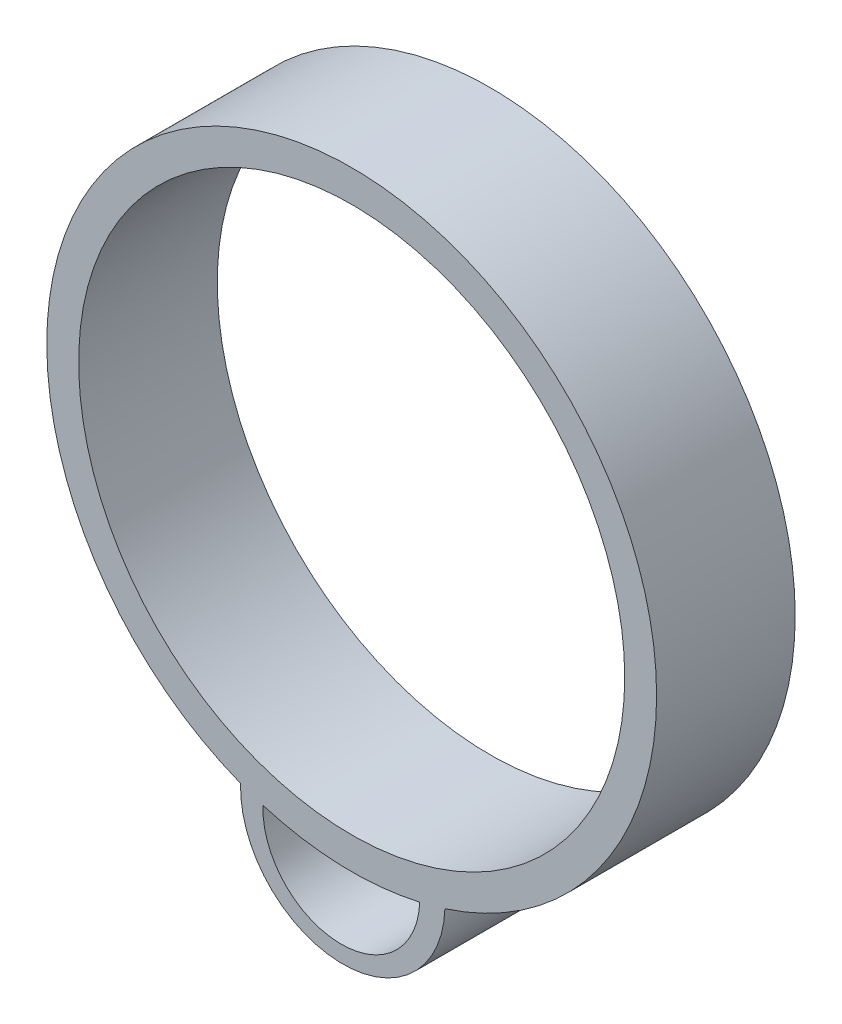
ISO-10303-21;
HEADER;
FILE_DESCRIPTION(('STEP AP214'),'2;1');
FILE_NAME('part.step','',(''),(''),'','','');
FILE_SCHEMA(('AUTOMOTIVE_DESIGN { 1 0 10303 214 1 1 1 1 }'));
ENDSEC;
DATA;
#1=APPLICATION_CONTEXT('core data for automotive mechanical design processes');
#2=APPLICATION_PROTOCOL_DEFINITION('international standard','automotive_design',2000,#1);
#3=PRODUCT_CONTEXT('',#1,'mechanical');
#4=PRODUCT('Part','Part','',(#3));
#5=PRODUCT_RELATED_PRODUCT_CATEGORY('part','',(#4));
#6=PRODUCT_DEFINITION_FORMATION('','',#4);
#7=PRODUCT_DEFINITION_CONTEXT('part definition',#1,'design');
#8=PRODUCT_DEFINITION('design','',#6,#7);
#9=PRODUCT_DEFINITION_SHAPE('','',#8);
#10=(LENGTH_UNIT() NAMED_UNIT(*) SI_UNIT(.MILLI.,.METRE.));
#11=(NAMED_UNIT(*) PLANE_ANGLE_UNIT() SI_UNIT($,.RADIAN.));
#12=(NAMED_UNIT(*) SI_UNIT($,.STERADIAN.) SOLID_ANGLE_UNIT());
#13=UNCERTAINTY_MEASURE_WITH_UNIT(LENGTH_MEASURE(1.E-05),#10,'distance_accuracy_value','');
#14=(GEOMETRIC_REPRESENTATION_CONTEXT(3) GLOBAL_UNCERTAINTY_ASSIGNED_CONTEXT((#13)) GLOBAL_UNIT_ASSIGNED_CONTEXT((#10,
#11,#12)) REPRESENTATION_CONTEXT('',''));
#15=CARTESIAN_POINT('',(0.,0.,0.));
#16=DIRECTION('',(0.,0.,1.));
#17=DIRECTION('',(1.,0.,0.));
#18=AXIS2_PLACEMENT_3D('',#15,#16,#17);
#19=CARTESIAN_POINT('',(0.,0.,12.7));
#20=DIRECTION('',(0.,0.,-1.));
#21=DIRECTION('',(-1.,0.,0.));
#22=AXIS2_PLACEMENT_3D('',#19,#20,#21);
#23=CYLINDRICAL_SURFACE('',#22,27.94);
#24=CARTESIAN_POINT('',(0.,0.,0.));
#25=DIRECTION('',(0.,0.,1.));
#26=DIRECTION('',(1.,0.,0.));
#27=AXIS2_PLACEMENT_3D('',#24,#25,#26);
#28=CIRCLE('',#27,27.94);
#29=CARTESIAN_POINT('',(8.53984045396244,-26.6029082060753,0.));
#30=VERTEX_POINT('',#29);
#31=CARTESIAN_POINT('',(-10.1827969993659,-26.0183443990909,0.));
#32=VERTEX_POINT('',#31);
#33=EDGE_CURVE('E122',#30,#32,#28,.T.);
#34=ORIENTED_EDGE('',*,*,#33,.T.);
#35=DIRECTION('',(0.,0.,-1.));
#36=VECTOR('',#35,1.);
#37=CARTESIAN_POINT('',(-10.1827969993659,-26.0183443990909,12.7));
#38=LINE('',#37,#36);
#39=CARTESIAN_POINT('',(-10.1827969993659,-26.0183443990909,12.7));
#40=VERTEX_POINT('',#39);
#41=EDGE_CURVE('E11',#40,#32,#38,.T.);
#42=ORIENTED_EDGE('',*,*,#41,.F.);
#43=CARTESIAN_POINT('',(0.,0.,12.7));
#44=DIRECTION('',(0.,0.,1.));
#45=DIRECTION('',(1.,0.,0.));
#46=AXIS2_PLACEMENT_3D('',#43,#44,#45);
#47=CIRCLE('',#46,27.94);
#48=CARTESIAN_POINT('',(8.53984045396244,-26.6029082060753,12.7));
#49=VERTEX_POINT('',#48);
#50=EDGE_CURVE('E95',#49,#40,#47,.T.);
#51=ORIENTED_EDGE('',*,*,#50,.F.);
#52=DIRECTION('',(0.,0.,-1.));
#53=VECTOR('',#52,1.);
#54=CARTESIAN_POINT('',(8.53984045396244,-26.6029082060753,12.7));
#55=LINE('',#54,#53);
#56=EDGE_CURVE('E52',#49,#30,#55,.T.);
#57=ORIENTED_EDGE('',*,*,#56,.T.);
#58=EDGE_LOOP('',(#34,#42,#51,#57));
#59=FACE_BOUND('',#58,.T.);
#60=ADVANCED_FACE('F41',(#59),#23,.T.);
#61=CARTESIAN_POINT('',(-0.950141992668552,-26.9833238919613,12.7));
#62=DIRECTION('',(0.,0.,-1.));
#63=DIRECTION('',(-1.,0.,0.));
#64=AXIS2_PLACEMENT_3D('',#61,#62,#63);
#65=CYLINDRICAL_SURFACE('',#64,7.18617157708335);
#66=CARTESIAN_POINT('',(-0.950141992668552,-26.9833238919613,0.));
#67=DIRECTION('',(0.,0.,1.));
#68=DIRECTION('',(1.,0.,0.));
#69=AXIS2_PLACEMENT_3D('',#66,#67,#68);
#70=CIRCLE('',#69,7.18617157708335);
#71=CARTESIAN_POINT('',(-8.13186264668566,-26.7304397624775,0.));
#72=VERTEX_POINT('',#71);
#73=CARTESIAN_POINT('',(6.23157866134855,-27.236208021445,0.));
#74=VERTEX_POINT('',#73);
#75=EDGE_CURVE('E117',#72,#74,#70,.T.);
#76=ORIENTED_EDGE('',*,*,#75,.F.);
#77=DIRECTION('',(0.,0.,-1.));
#78=VECTOR('',#77,1.);
#79=CARTESIAN_POINT('',(-8.13186264668566,-26.7304397624775,12.7));
#80=LINE('',#79,#78);
#81=CARTESIAN_POINT('',(-8.13186264668566,-26.7304397624775,12.7));
#82=VERTEX_POINT('',#81);
#83=EDGE_CURVE('E45',#82,#72,#80,.T.);
#84=ORIENTED_EDGE('',*,*,#83,.F.);
#85=CARTESIAN_POINT('',(-0.950141992668552,-26.9833238919613,12.7));
#86=DIRECTION('',(0.,0.,1.));
#87=DIRECTION('',(1.,0.,0.));
#88=AXIS2_PLACEMENT_3D('',#85,#86,#87);
#89=CIRCLE('',#88,7.18617157708335);
#90=CARTESIAN_POINT('',(6.23157866134855,-27.236208021445,12.7));
#91=VERTEX_POINT('',#90);
#92=EDGE_CURVE('E92',#82,#91,#89,.T.);
#93=ORIENTED_EDGE('',*,*,#92,.T.);
#94=DIRECTION('',(0.,0.,-1.));
#95=VECTOR('',#94,1.);
#96=CARTESIAN_POINT('',(6.23157866134855,-27.236208021445,12.7));
#97=LINE('',#96,#95);
#98=EDGE_CURVE('E98',#91,#74,#97,.T.);
#99=ORIENTED_EDGE('',*,*,#98,.T.);
#100=EDGE_LOOP('',(#76,#84,#93,#99));
#101=FACE_BOUND('',#100,.T.);
#102=ADVANCED_FACE('F43',(#101),#65,.F.);
#103=CARTESIAN_POINT('',(-0.821478272701751,-26.3106263025831,12.7));
#104=DIRECTION('',(0.,0.,-1.));
#105=DIRECTION('',(-1.,0.,0.));
#106=AXIS2_PLACEMENT_3D('',#103,#104,#105);
#107=CYLINDRICAL_SURFACE('',#106,9.36588047186716);
#108=CARTESIAN_POINT('',(-0.821478272701751,-26.3106263025831,0.));
#109=DIRECTION('',(0.,0.,1.));
#110=DIRECTION('',(1.,0.,0.));
#111=AXIS2_PLACEMENT_3D('',#108,#109,#110);
#112=CIRCLE('',#111,9.36588047186716);
#113=EDGE_CURVE('E76',#32,#30,#112,.T.);
#114=ORIENTED_EDGE('',*,*,#113,.T.);
#115=ORIENTED_EDGE('',*,*,#56,.F.);
#116=CARTESIAN_POINT('',(-0.821478272701751,-26.3106263025831,12.7));
#117=DIRECTION('',(0.,0.,1.));
#118=DIRECTION('',(1.,0.,0.));
#119=AXIS2_PLACEMENT_3D('',#116,#117,#118);
#120=CIRCLE('',#119,9.36588047186716);
#121=EDGE_CURVE('E60',#40,#49,#120,.T.);
#122=ORIENTED_EDGE('',*,*,#121,.F.);
#123=ORIENTED_EDGE('',*,*,#41,.T.);
#124=EDGE_LOOP('',(#114,#115,#122,#123));
#125=FACE_BOUND('',#124,.T.);
#126=ADVANCED_FACE('F146',(#125),#107,.T.);
#127=EDGE_CURVE('E101',#72,#74,#28,.T.);
#128=ORIENTED_EDGE('',*,*,#127,.T.);
#129=ORIENTED_EDGE('',*,*,#98,.F.);
#130=EDGE_CURVE('E89',#82,#91,#47,.T.);
#131=ORIENTED_EDGE('',*,*,#130,.F.);
#132=ORIENTED_EDGE('',*,*,#83,.T.);
#133=EDGE_LOOP('',(#128,#129,#131,#132));
#134=FACE_BOUND('',#133,.T.);
#135=ADVANCED_FACE('F99',(#134),#23,.T.);
#136=CARTESIAN_POINT('',(0.,0.,12.7));
#137=DIRECTION('',(0.,0.,-1.));
#138=DIRECTION('',(-1.,0.,0.));
#139=AXIS2_PLACEMENT_3D('',#136,#137,#138);
#140=CYLINDRICAL_SURFACE('',#139,25.019);
#141=CARTESIAN_POINT('',(0.,0.,12.7));
#142=DIRECTION('',(0.,0.,1.));
#143=DIRECTION('',(1.,0.,0.));
#144=AXIS2_PLACEMENT_3D('',#141,#142,#143);
#145=CIRCLE('',#144,25.019);
#146=CARTESIAN_POINT('',(25.019,0.,12.7));
#147=VERTEX_POINT('',#146);
#148=EDGE_CURVE('E104',#147,#147,#145,.T.);
#149=ORIENTED_EDGE('',*,*,#148,.T.);
#150=EDGE_LOOP('',(#149));
#151=FACE_BOUND('',#150,.T.);
#152=CARTESIAN_POINT('',(0.,0.,0.));
#153=DIRECTION('',(0.,0.,1.));
#154=DIRECTION('',(1.,0.,0.));
#155=AXIS2_PLACEMENT_3D('',#152,#153,#154);
#156=CIRCLE('',#155,25.019);
#157=CARTESIAN_POINT('',(25.019,0.,0.));
#158=VERTEX_POINT('',#157);
#159=EDGE_CURVE('E106',#158,#158,#156,.T.);
#160=ORIENTED_EDGE('',*,*,#159,.F.);
#161=EDGE_LOOP('',(#160));
#162=FACE_BOUND('',#161,.T.);
#163=ADVANCED_FACE('F137',(#151,#162),#140,.F.);
#164=CARTESIAN_POINT('',(0.,0.,12.7));
#165=DIRECTION('',(0.,0.,1.));
#166=DIRECTION('',(1.,0.,0.));
#167=AXIS2_PLACEMENT_3D('',#164,#165,#166);
#168=PLANE('',#167);
#169=ORIENTED_EDGE('',*,*,#92,.F.);
#170=ORIENTED_EDGE('',*,*,#130,.T.);
#171=EDGE_LOOP('',(#169,#170));
#172=FACE_BOUND('',#171,.T.);
#173=ORIENTED_EDGE('',*,*,#50,.T.);
#174=ORIENTED_EDGE('',*,*,#121,.T.);
#175=EDGE_LOOP('',(#173,#174));
#176=FACE_BOUND('',#175,.T.);
#177=ORIENTED_EDGE('',*,*,#148,.F.);
#178=EDGE_LOOP('',(#177));
#179=FACE_BOUND('',#178,.T.);
#180=ADVANCED_FACE('F91',(#172,#176,#179),#168,.T.);
#181=CARTESIAN_POINT('',(0.,0.,0.));
#182=DIRECTION('',(0.,0.,1.));
#183=DIRECTION('',(1.,0.,0.));
#184=AXIS2_PLACEMENT_3D('',#181,#182,#183);
#185=PLANE('',#184);
#186=ORIENTED_EDGE('',*,*,#75,.T.);
#187=ORIENTED_EDGE('',*,*,#127,.F.);
#188=EDGE_LOOP('',(#186,#187));
#189=FACE_BOUND('',#188,.T.);
#190=ORIENTED_EDGE('',*,*,#33,.F.);
#191=ORIENTED_EDGE('',*,*,#113,.F.);
#192=EDGE_LOOP('',(#190,#191));
#193=FACE_BOUND('',#192,.T.);
#194=ORIENTED_EDGE('',*,*,#159,.T.);
#195=EDGE_LOOP('',(#194));
#196=FACE_BOUND('',#195,.T.);
#197=ADVANCED_FACE('F131',(#189,#193,#196),#185,.F.);
#198=CLOSED_SHELL('',(#60,#102,#126,#135,#163,#180,#197));
#199=MANIFOLD_SOLID_BREP('B2',#198);
#200=ADVANCED_BREP_SHAPE_REPRESENTATION('',(#18,#199),#14);
#201=SHAPE_DEFINITION_REPRESENTATION(#9,#200);
ENDSEC;
END-ISO-10303-21;
